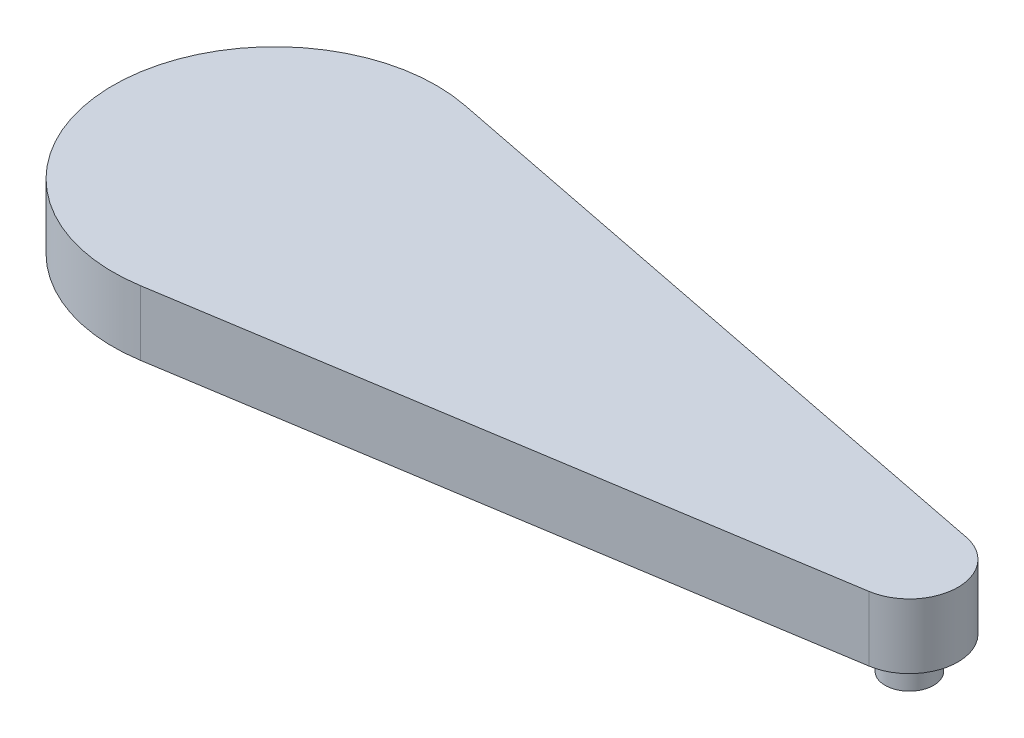
ISO-10303-21;
HEADER;
FILE_DESCRIPTION(('STEP AP214'),'2;1');
FILE_NAME('part.step','',(''),(''),'','','');
FILE_SCHEMA(('AUTOMOTIVE_DESIGN { 1 0 10303 214 1 1 1 1 }'));
ENDSEC;
DATA;
#1=APPLICATION_CONTEXT('core data for automotive mechanical design processes');
#2=APPLICATION_PROTOCOL_DEFINITION('international standard','automotive_design',2000,#1);
#3=PRODUCT_CONTEXT('',#1,'mechanical');
#4=PRODUCT('Part','Part','',(#3));
#5=PRODUCT_RELATED_PRODUCT_CATEGORY('part','',(#4));
#6=PRODUCT_DEFINITION_FORMATION('','',#4);
#7=PRODUCT_DEFINITION_CONTEXT('part definition',#1,'design');
#8=PRODUCT_DEFINITION('design','',#6,#7);
#9=PRODUCT_DEFINITION_SHAPE('','',#8);
#10=(LENGTH_UNIT() NAMED_UNIT(*) SI_UNIT(.MILLI.,.METRE.));
#11=(NAMED_UNIT(*) PLANE_ANGLE_UNIT() SI_UNIT($,.RADIAN.));
#12=(NAMED_UNIT(*) SI_UNIT($,.STERADIAN.) SOLID_ANGLE_UNIT());
#13=UNCERTAINTY_MEASURE_WITH_UNIT(LENGTH_MEASURE(1.E-05),#10,'distance_accuracy_value','');
#14=(GEOMETRIC_REPRESENTATION_CONTEXT(3) GLOBAL_UNCERTAINTY_ASSIGNED_CONTEXT((#13)) GLOBAL_UNIT_ASSIGNED_CONTEXT((#10,
#11,#12)) REPRESENTATION_CONTEXT('',''));
#15=CARTESIAN_POINT('',(0.,0.,0.));
#16=DIRECTION('',(0.,0.,1.));
#17=DIRECTION('',(1.,0.,0.));
#18=AXIS2_PLACEMENT_3D('',#15,#16,#17);
#19=CARTESIAN_POINT('',(100.,10.,1.89652606952907));
#20=DIRECTION('',(0.,-1.,0.));
#21=DIRECTION('',(0.,0.,-1.));
#22=AXIS2_PLACEMENT_3D('',#19,#20,#21);
#23=CYLINDRICAL_SURFACE('',#22,7.50000000000001);
#24=CARTESIAN_POINT('',(100.,0.,1.89652606952907));
#25=DIRECTION('',(0.,1.,0.));
#26=DIRECTION('',(0.,0.,1.));
#27=AXIS2_PLACEMENT_3D('',#24,#25,#26);
#28=CIRCLE('',#27,7.50000000000001);
#29=CARTESIAN_POINT('',(101.172007994329,0.,9.3043865745082));
#30=VERTEX_POINT('',#29);
#31=CARTESIAN_POINT('',(101.452048182224,0.,-5.46156852598264));
#32=VERTEX_POINT('',#31);
#33=EDGE_CURVE('E202',#30,#32,#28,.T.);
#34=ORIENTED_EDGE('',*,*,#33,.T.);
#35=DIRECTION('',(0.,-1.,0.));
#36=VECTOR('',#35,1.);
#37=CARTESIAN_POINT('',(101.452048182224,10.,-5.46156852598264));
#38=LINE('',#37,#36);
#39=CARTESIAN_POINT('',(101.452048182224,10.,-5.46156852598264));
#40=VERTEX_POINT('',#39);
#41=EDGE_CURVE('E11',#40,#32,#38,.T.);
#42=ORIENTED_EDGE('',*,*,#41,.F.);
#43=CARTESIAN_POINT('',(100.,10.,1.89652606952907));
#44=DIRECTION('',(0.,1.,0.));
#45=DIRECTION('',(0.,0.,1.));
#46=AXIS2_PLACEMENT_3D('',#43,#44,#45);
#47=CIRCLE('',#46,7.50000000000001);
#48=CARTESIAN_POINT('',(101.172007994329,10.,9.3043865745082));
#49=VERTEX_POINT('',#48);
#50=EDGE_CURVE('E216',#49,#40,#47,.T.);
#51=ORIENTED_EDGE('',*,*,#50,.F.);
#52=DIRECTION('',(0.,-1.,0.));
#53=VECTOR('',#52,1.);
#54=CARTESIAN_POINT('',(101.172007994329,10.,9.3043865745082));
#55=LINE('',#54,#53);
#56=EDGE_CURVE('E222',#49,#30,#55,.T.);
#57=ORIENTED_EDGE('',*,*,#56,.T.);
#58=EDGE_LOOP('',(#34,#42,#51,#57));
#59=FACE_BOUND('',#58,.T.);
#60=ADVANCED_FACE('F43',(#59),#23,.T.);
#61=CARTESIAN_POINT('',(101.452048182224,10.,-5.46156852598264));
#62=DIRECTION('',(-0.193606424296599,0.,0.981079279401561));
#63=DIRECTION('',(0.981079279401561,0.,0.193606424296599));
#64=AXIS2_PLACEMENT_3D('',#61,#62,#63);
#65=PLANE('',#64);
#66=DIRECTION('',(-0.981079279401561,0.,-0.193606424296599));
#67=VECTOR('',#66,1.);
#68=CARTESIAN_POINT('',(101.452048182224,0.,-5.46156852598264));
#69=LINE('',#68,#67);
#70=CARTESIAN_POINT('',(4.84016060741497,0.,-24.526981985039));
#71=VERTEX_POINT('',#70);
#72=EDGE_CURVE('E225',#32,#71,#69,.T.);
#73=ORIENTED_EDGE('',*,*,#72,.T.);
#74=DIRECTION('',(0.,-1.,0.));
#75=VECTOR('',#74,1.);
#76=CARTESIAN_POINT('',(4.84016060741497,10.,-24.526981985039));
#77=LINE('',#76,#75);
#78=CARTESIAN_POINT('',(4.84016060741497,10.,-24.526981985039));
#79=VERTEX_POINT('',#78);
#80=EDGE_CURVE('E50',#79,#71,#77,.T.);
#81=ORIENTED_EDGE('',*,*,#80,.F.);
#82=DIRECTION('',(-0.981079279401561,0.,-0.193606424296599));
#83=VECTOR('',#82,1.);
#84=CARTESIAN_POINT('',(101.452048182224,10.,-5.46156852598264));
#85=LINE('',#84,#83);
#86=EDGE_CURVE('E94',#40,#79,#85,.T.);
#87=ORIENTED_EDGE('',*,*,#86,.F.);
#88=ORIENTED_EDGE('',*,*,#41,.T.);
#89=EDGE_LOOP('',(#73,#81,#87,#88));
#90=FACE_BOUND('',#89,.T.);
#91=ADVANCED_FACE('F253',(#90),#65,.F.);
#92=CARTESIAN_POINT('',(0.,10.,0.));
#93=DIRECTION('',(0.,-1.,0.));
#94=DIRECTION('',(0.,0.,-1.));
#95=AXIS2_PLACEMENT_3D('',#92,#93,#94);
#96=CYLINDRICAL_SURFACE('',#95,25.);
#97=CARTESIAN_POINT('',(0.,0.,0.));
#98=DIRECTION('',(0.,1.,0.));
#99=DIRECTION('',(0.,0.,1.));
#100=AXIS2_PLACEMENT_3D('',#97,#98,#99);
#101=CIRCLE('',#100,25.);
#102=CARTESIAN_POINT('',(3.90669331442909,0.,24.6928683499304));
#103=VERTEX_POINT('',#102);
#104=EDGE_CURVE('E227',#71,#103,#101,.T.);
#105=ORIENTED_EDGE('',*,*,#104,.T.);
#106=DIRECTION('',(0.,-1.,0.));
#107=VECTOR('',#106,1.);
#108=CARTESIAN_POINT('',(3.90669331442909,10.,24.6928683499304));
#109=LINE('',#108,#107);
#110=CARTESIAN_POINT('',(3.90669331442909,10.,24.6928683499304));
#111=VERTEX_POINT('',#110);
#112=EDGE_CURVE('E231',#111,#103,#109,.T.);
#113=ORIENTED_EDGE('',*,*,#112,.F.);
#114=CARTESIAN_POINT('',(0.,10.,0.));
#115=DIRECTION('',(0.,1.,0.));
#116=DIRECTION('',(0.,0.,1.));
#117=AXIS2_PLACEMENT_3D('',#114,#115,#116);
#118=CIRCLE('',#117,25.);
#119=EDGE_CURVE('E219',#79,#111,#118,.T.);
#120=ORIENTED_EDGE('',*,*,#119,.F.);
#121=ORIENTED_EDGE('',*,*,#80,.T.);
#122=EDGE_LOOP('',(#105,#113,#120,#121));
#123=FACE_BOUND('',#122,.T.);
#124=ADVANCED_FACE('F236',(#123),#96,.T.);
#125=CARTESIAN_POINT('',(101.172007994329,10.,9.3043865745082));
#126=DIRECTION('',(-0.156267732577163,0.,-0.987714733997217));
#127=DIRECTION('',(-0.987714733997217,0.,0.156267732577163));
#128=AXIS2_PLACEMENT_3D('',#125,#126,#127);
#129=PLANE('',#128);
#130=DIRECTION('',(0.987714733997217,0.,-0.156267732577163));
#131=VECTOR('',#130,1.);
#132=CARTESIAN_POINT('',(101.172007994329,0.,9.3043865745082));
#133=LINE('',#132,#131);
#134=EDGE_CURVE('E87',#103,#30,#133,.T.);
#135=ORIENTED_EDGE('',*,*,#134,.T.);
#136=ORIENTED_EDGE('',*,*,#56,.F.);
#137=DIRECTION('',(0.987714733997217,0.,-0.156267732577163));
#138=VECTOR('',#137,1.);
#139=CARTESIAN_POINT('',(101.172007994329,10.,9.3043865745082));
#140=LINE('',#139,#138);
#141=EDGE_CURVE('E66',#111,#49,#140,.T.);
#142=ORIENTED_EDGE('',*,*,#141,.F.);
#143=ORIENTED_EDGE('',*,*,#112,.T.);
#144=EDGE_LOOP('',(#135,#136,#142,#143));
#145=FACE_BOUND('',#144,.T.);
#146=ADVANCED_FACE('F244',(#145),#129,.F.);
#147=CARTESIAN_POINT('',(100.,10.,1.89652606952907));
#148=DIRECTION('',(0.,1.,0.));
#149=DIRECTION('',(0.,0.,1.));
#150=AXIS2_PLACEMENT_3D('',#147,#148,#149);
#151=PLANE('',#150);
#152=ORIENTED_EDGE('',*,*,#50,.T.);
#153=ORIENTED_EDGE('',*,*,#86,.T.);
#154=ORIENTED_EDGE('',*,*,#119,.T.);
#155=ORIENTED_EDGE('',*,*,#141,.T.);
#156=EDGE_LOOP('',(#152,#153,#154,#155));
#157=FACE_BOUND('',#156,.T.);
#158=ADVANCED_FACE('F246',(#157),#151,.T.);
#159=CARTESIAN_POINT('',(100.,0.,1.89652606952907));
#160=DIRECTION('',(0.,1.,0.));
#161=DIRECTION('',(0.,0.,1.));
#162=AXIS2_PLACEMENT_3D('',#159,#160,#161);
#163=PLANE('',#162);
#164=DIRECTION('',(-0.984306181037937,0.,0.176469096361123));
#165=VECTOR('',#164,1.);
#166=CARTESIAN_POINT('',(17.5294072730355,0.,2.95291852296135));
#167=LINE('',#166,#165);
#168=CARTESIAN_POINT('',(17.5294072730355,0.,2.95291852296135));
#169=VERTEX_POINT('',#168);
#170=CARTESIAN_POINT('',(1.07598840365978,0.,5.90273232669805));
#171=VERTEX_POINT('',#170);
#172=EDGE_CURVE('E183',#169,#171,#167,.T.);
#173=ORIENTED_EDGE('',*,*,#172,.F.);
#174=CARTESIAN_POINT('',(16.9999998715484,0.,0.));
#175=DIRECTION('',(0.,-1.,0.));
#176=DIRECTION('',(0.,0.,-1.));
#177=AXIS2_PLACEMENT_3D('',#174,#175,#176);
#178=CIRCLE('',#177,2.99999999999961);
#179=CARTESIAN_POINT('',(17.529407273035,0.,-2.95291852296144));
#180=VERTEX_POINT('',#179);
#181=EDGE_CURVE('E57',#180,#169,#178,.T.);
#182=ORIENTED_EDGE('',*,*,#181,.F.);
#183=DIRECTION('',(0.984306181037938,0.,0.176469096361121));
#184=VECTOR('',#183,1.);
#185=CARTESIAN_POINT('',(17.529407273035,0.,-2.95291852296144));
#186=LINE('',#185,#184);
#187=CARTESIAN_POINT('',(1.07598840366077,0.,-5.90273232669858));
#188=VERTEX_POINT('',#187);
#189=EDGE_CURVE('E161',#188,#180,#186,.T.);
#190=ORIENTED_EDGE('',*,*,#189,.F.);
#191=CARTESIAN_POINT('',(-1.60479793142367E-08,0.,0.));
#192=DIRECTION('',(0.,-1.,0.));
#193=DIRECTION('',(0.,0.,-1.));
#194=AXIS2_PLACEMENT_3D('',#191,#192,#193);
#195=CIRCLE('',#194,5.99999999999998);
#196=CARTESIAN_POINT('',(-1.07598842178457,0.,-5.90273232924551));
#197=VERTEX_POINT('',#196);
#198=EDGE_CURVE('E164',#197,#188,#195,.T.);
#199=ORIENTED_EDGE('',*,*,#198,.F.);
#200=DIRECTION('',(0.984306181456321,0.,-0.176469094027473));
#201=VECTOR('',#200,1.);
#202=CARTESIAN_POINT('',(-17.5294072981501,0.,-2.95291856451748));
#203=LINE('',#202,#201);
#204=CARTESIAN_POINT('',(-17.5294072981501,0.,-2.95291856451748));
#205=VERTEX_POINT('',#204);
#206=EDGE_CURVE('E195',#205,#197,#203,.T.);
#207=ORIENTED_EDGE('',*,*,#206,.F.);
#208=CARTESIAN_POINT('',(-17.0000001284516,0.,0.));
#209=DIRECTION('',(0.,-1.,0.));
#210=DIRECTION('',(0.,0.,-1.));
#211=AXIS2_PLACEMENT_3D('',#208,#209,#210);
#212=CIRCLE('',#211,3.00000000000002);
#213=CARTESIAN_POINT('',(-17.529407298126,0.,2.95291856452179));
#214=VERTEX_POINT('',#213);
#215=EDGE_CURVE('E192',#214,#205,#212,.T.);
#216=ORIENTED_EDGE('',*,*,#215,.F.);
#217=DIRECTION('',(-0.984306181456334,0.,-0.176469094027395));
#218=VECTOR('',#217,1.);
#219=CARTESIAN_POINT('',(-17.529407298126,0.,2.95291856452179));
#220=LINE('',#219,#218);
#221=CARTESIAN_POINT('',(-1.07598842175312,0.,5.9027323292498));
#222=VERTEX_POINT('',#221);
#223=EDGE_CURVE('E189',#222,#214,#220,.T.);
#224=ORIENTED_EDGE('',*,*,#223,.F.);
#225=CARTESIAN_POINT('',(-1.60479793142367E-08,0.,0.));
#226=DIRECTION('',(0.,-1.,0.));
#227=DIRECTION('',(0.,0.,-1.));
#228=AXIS2_PLACEMENT_3D('',#225,#226,#227);
#229=CIRCLE('',#228,5.99999999999929);
#230=EDGE_CURVE('E186',#171,#222,#229,.T.);
#231=ORIENTED_EDGE('',*,*,#230,.F.);
#232=EDGE_LOOP('',(#173,#182,#190,#199,#207,#216,#224,#231));
#233=FACE_BOUND('',#232,.T.);
#234=CARTESIAN_POINT('',(100.,0.,1.89652606952907));
#235=DIRECTION('',(0.,-1.,0.));
#236=DIRECTION('',(0.,0.,-1.));
#237=AXIS2_PLACEMENT_3D('',#234,#235,#236);
#238=CIRCLE('',#237,3.75000000000001);
#239=CARTESIAN_POINT('',(100.,0.,-1.85347393047094));
#240=VERTEX_POINT('',#239);
#241=EDGE_CURVE('E184',#240,#240,#238,.T.);
#242=ORIENTED_EDGE('',*,*,#241,.F.);
#243=EDGE_LOOP('',(#242));
#244=FACE_BOUND('',#243,.T.);
#245=ORIENTED_EDGE('',*,*,#33,.F.);
#246=ORIENTED_EDGE('',*,*,#134,.F.);
#247=ORIENTED_EDGE('',*,*,#104,.F.);
#248=ORIENTED_EDGE('',*,*,#72,.F.);
#249=EDGE_LOOP('',(#245,#246,#247,#248));
#250=FACE_BOUND('',#249,.T.);
#251=ADVANCED_FACE('F240',(#233,#244,#250),#163,.F.);
#252=CARTESIAN_POINT('',(16.9999998715484,5.,0.));
#253=DIRECTION('',(0.,-1.,0.));
#254=DIRECTION('',(0.,0.,-1.));
#255=AXIS2_PLACEMENT_3D('',#252,#253,#254);
#256=CYLINDRICAL_SURFACE('',#255,2.99999999999961);
#257=ORIENTED_EDGE('',*,*,#181,.T.);
#258=DIRECTION('',(0.,-1.,0.));
#259=VECTOR('',#258,1.);
#260=CARTESIAN_POINT('',(17.5294072730355,5.,2.95291852296135));
#261=LINE('',#260,#259);
#262=CARTESIAN_POINT('',(17.5294072730355,5.,2.95291852296135));
#263=VERTEX_POINT('',#262);
#264=EDGE_CURVE('E138',#263,#169,#261,.T.);
#265=ORIENTED_EDGE('',*,*,#264,.F.);
#266=CARTESIAN_POINT('',(16.9999998715484,5.,0.));
#267=DIRECTION('',(0.,-1.,0.));
#268=DIRECTION('',(0.,0.,-1.));
#269=AXIS2_PLACEMENT_3D('',#266,#267,#268);
#270=CIRCLE('',#269,2.99999999999961);
#271=CARTESIAN_POINT('',(17.529407273035,5.,-2.95291852296144));
#272=VERTEX_POINT('',#271);
#273=EDGE_CURVE('E142',#272,#263,#270,.T.);
#274=ORIENTED_EDGE('',*,*,#273,.F.);
#275=DIRECTION('',(0.,-1.,0.));
#276=VECTOR('',#275,1.);
#277=CARTESIAN_POINT('',(17.529407273035,5.,-2.95291852296144));
#278=LINE('',#277,#276);
#279=EDGE_CURVE('E200',#272,#180,#278,.T.);
#280=ORIENTED_EDGE('',*,*,#279,.T.);
#281=EDGE_LOOP('',(#257,#265,#274,#280));
#282=FACE_BOUND('',#281,.T.);
#283=ADVANCED_FACE('F140',(#282),#256,.F.);
#284=CARTESIAN_POINT('',(17.529407273035,5.,-2.95291852296144));
#285=DIRECTION('',(0.176469096361121,0.,-0.984306181037938));
#286=DIRECTION('',(-0.984306181037938,0.,-0.176469096361121));
#287=AXIS2_PLACEMENT_3D('',#284,#285,#286);
#288=PLANE('',#287);
#289=ORIENTED_EDGE('',*,*,#189,.T.);
#290=ORIENTED_EDGE('',*,*,#279,.F.);
#291=DIRECTION('',(0.984306181037938,0.,0.176469096361121));
#292=VECTOR('',#291,1.);
#293=CARTESIAN_POINT('',(17.529407273035,5.,-2.95291852296144));
#294=LINE('',#293,#292);
#295=CARTESIAN_POINT('',(1.07598840366077,5.,-5.90273232669858));
#296=VERTEX_POINT('',#295);
#297=EDGE_CURVE('E148',#296,#272,#294,.T.);
#298=ORIENTED_EDGE('',*,*,#297,.F.);
#299=DIRECTION('',(0.,-1.,0.));
#300=VECTOR('',#299,1.);
#301=CARTESIAN_POINT('',(1.07598840366077,5.,-5.90273232669858));
#302=LINE('',#301,#300);
#303=EDGE_CURVE('E203',#296,#188,#302,.T.);
#304=ORIENTED_EDGE('',*,*,#303,.T.);
#305=EDGE_LOOP('',(#289,#290,#298,#304));
#306=FACE_BOUND('',#305,.T.);
#307=ADVANCED_FACE('F297',(#306),#288,.F.);
#308=CARTESIAN_POINT('',(-1.60479793142367E-08,5.,0.));
#309=DIRECTION('',(0.,-1.,0.));
#310=DIRECTION('',(0.,0.,-1.));
#311=AXIS2_PLACEMENT_3D('',#308,#309,#310);
#312=CYLINDRICAL_SURFACE('',#311,5.99999999999998);
#313=ORIENTED_EDGE('',*,*,#198,.T.);
#314=ORIENTED_EDGE('',*,*,#303,.F.);
#315=CARTESIAN_POINT('',(-1.60479793142367E-08,5.,0.));
#316=DIRECTION('',(0.,-1.,0.));
#317=DIRECTION('',(0.,0.,-1.));
#318=AXIS2_PLACEMENT_3D('',#315,#316,#317);
#319=CIRCLE('',#318,5.99999999999998);
#320=CARTESIAN_POINT('',(-1.07598842178457,5.,-5.90273232924551));
#321=VERTEX_POINT('',#320);
#322=EDGE_CURVE('E179',#321,#296,#319,.T.);
#323=ORIENTED_EDGE('',*,*,#322,.F.);
#324=DIRECTION('',(0.,-1.,0.));
#325=VECTOR('',#324,1.);
#326=CARTESIAN_POINT('',(-1.07598842178457,5.,-5.90273232924551));
#327=LINE('',#326,#325);
#328=EDGE_CURVE('E205',#321,#197,#327,.T.);
#329=ORIENTED_EDGE('',*,*,#328,.T.);
#330=EDGE_LOOP('',(#313,#314,#323,#329));
#331=FACE_BOUND('',#330,.T.);
#332=ADVANCED_FACE('F307',(#331),#312,.F.);
#333=CARTESIAN_POINT('',(-17.5294072981501,5.,-2.95291856451748));
#334=DIRECTION('',(-0.176469094027473,0.,-0.984306181456321));
#335=DIRECTION('',(-0.984306181456321,0.,0.176469094027473));
#336=AXIS2_PLACEMENT_3D('',#333,#334,#335);
#337=PLANE('',#336);
#338=ORIENTED_EDGE('',*,*,#206,.T.);
#339=ORIENTED_EDGE('',*,*,#328,.F.);
#340=DIRECTION('',(0.984306181456321,0.,-0.176469094027473));
#341=VECTOR('',#340,1.);
#342=CARTESIAN_POINT('',(-17.5294072981501,5.,-2.95291856451748));
#343=LINE('',#342,#341);
#344=CARTESIAN_POINT('',(-17.5294072981501,5.,-2.95291856451748));
#345=VERTEX_POINT('',#344);
#346=EDGE_CURVE('E176',#345,#321,#343,.T.);
#347=ORIENTED_EDGE('',*,*,#346,.F.);
#348=DIRECTION('',(0.,-1.,0.));
#349=VECTOR('',#348,1.);
#350=CARTESIAN_POINT('',(-17.5294072981501,5.,-2.95291856451748));
#351=LINE('',#350,#349);
#352=EDGE_CURVE('E207',#345,#205,#351,.T.);
#353=ORIENTED_EDGE('',*,*,#352,.T.);
#354=EDGE_LOOP('',(#338,#339,#347,#353));
#355=FACE_BOUND('',#354,.T.);
#356=ADVANCED_FACE('F318',(#355),#337,.F.);
#357=CARTESIAN_POINT('',(-17.0000001284516,5.,0.));
#358=DIRECTION('',(0.,-1.,0.));
#359=DIRECTION('',(0.,0.,-1.));
#360=AXIS2_PLACEMENT_3D('',#357,#358,#359);
#361=CYLINDRICAL_SURFACE('',#360,3.00000000000002);
#362=ORIENTED_EDGE('',*,*,#215,.T.);
#363=ORIENTED_EDGE('',*,*,#352,.F.);
#364=CARTESIAN_POINT('',(-17.0000001284516,5.,0.));
#365=DIRECTION('',(0.,-1.,0.));
#366=DIRECTION('',(0.,0.,-1.));
#367=AXIS2_PLACEMENT_3D('',#364,#365,#366);
#368=CIRCLE('',#367,3.00000000000002);
#369=CARTESIAN_POINT('',(-17.529407298126,5.,2.95291856452179));
#370=VERTEX_POINT('',#369);
#371=EDGE_CURVE('E173',#370,#345,#368,.T.);
#372=ORIENTED_EDGE('',*,*,#371,.F.);
#373=DIRECTION('',(0.,-1.,0.));
#374=VECTOR('',#373,1.);
#375=CARTESIAN_POINT('',(-17.529407298126,5.,2.95291856452179));
#376=LINE('',#375,#374);
#377=EDGE_CURVE('E209',#370,#214,#376,.T.);
#378=ORIENTED_EDGE('',*,*,#377,.T.);
#379=EDGE_LOOP('',(#362,#363,#372,#378));
#380=FACE_BOUND('',#379,.T.);
#381=ADVANCED_FACE('F329',(#380),#361,.F.);
#382=CARTESIAN_POINT('',(-17.529407298126,5.,2.95291856452179));
#383=DIRECTION('',(-0.176469094027395,0.,0.984306181456335));
#384=DIRECTION('',(0.984306181456335,0.,0.176469094027395));
#385=AXIS2_PLACEMENT_3D('',#382,#383,#384);
#386=PLANE('',#385);
#387=ORIENTED_EDGE('',*,*,#223,.T.);
#388=ORIENTED_EDGE('',*,*,#377,.F.);
#389=DIRECTION('',(-0.984306181456334,0.,-0.176469094027395));
#390=VECTOR('',#389,1.);
#391=CARTESIAN_POINT('',(-17.529407298126,5.,2.95291856452179));
#392=LINE('',#391,#390);
#393=CARTESIAN_POINT('',(-1.07598842175312,5.,5.9027323292498));
#394=VERTEX_POINT('',#393);
#395=EDGE_CURVE('E170',#394,#370,#392,.T.);
#396=ORIENTED_EDGE('',*,*,#395,.F.);
#397=DIRECTION('',(0.,-1.,0.));
#398=VECTOR('',#397,1.);
#399=CARTESIAN_POINT('',(-1.07598842175312,5.,5.9027323292498));
#400=LINE('',#399,#398);
#401=EDGE_CURVE('E211',#394,#222,#400,.T.);
#402=ORIENTED_EDGE('',*,*,#401,.T.);
#403=EDGE_LOOP('',(#387,#388,#396,#402));
#404=FACE_BOUND('',#403,.T.);
#405=ADVANCED_FACE('F340',(#404),#386,.F.);
#406=CARTESIAN_POINT('',(-1.60479793142367E-08,5.,0.));
#407=DIRECTION('',(0.,-1.,0.));
#408=DIRECTION('',(0.,0.,-1.));
#409=AXIS2_PLACEMENT_3D('',#406,#407,#408);
#410=CYLINDRICAL_SURFACE('',#409,5.99999999999929);
#411=ORIENTED_EDGE('',*,*,#230,.T.);
#412=ORIENTED_EDGE('',*,*,#401,.F.);
#413=CARTESIAN_POINT('',(-1.60479793142367E-08,5.,0.));
#414=DIRECTION('',(0.,-1.,0.));
#415=DIRECTION('',(0.,0.,-1.));
#416=AXIS2_PLACEMENT_3D('',#413,#414,#415);
#417=CIRCLE('',#416,5.99999999999929);
#418=CARTESIAN_POINT('',(1.07598840365978,5.,5.90273232669805));
#419=VERTEX_POINT('',#418);
#420=EDGE_CURVE('E156',#419,#394,#417,.T.);
#421=ORIENTED_EDGE('',*,*,#420,.F.);
#422=DIRECTION('',(0.,-1.,0.));
#423=VECTOR('',#422,1.);
#424=CARTESIAN_POINT('',(1.07598840365978,5.,5.90273232669805));
#425=LINE('',#424,#423);
#426=EDGE_CURVE('E147',#419,#171,#425,.T.);
#427=ORIENTED_EDGE('',*,*,#426,.T.);
#428=EDGE_LOOP('',(#411,#412,#421,#427));
#429=FACE_BOUND('',#428,.T.);
#430=ADVANCED_FACE('F351',(#429),#410,.F.);
#431=CARTESIAN_POINT('',(17.5294072730355,5.,2.95291852296135));
#432=DIRECTION('',(0.176469096361123,0.,0.984306181037937));
#433=DIRECTION('',(0.984306181037937,0.,-0.176469096361123));
#434=AXIS2_PLACEMENT_3D('',#431,#432,#433);
#435=PLANE('',#434);
#436=ORIENTED_EDGE('',*,*,#172,.T.);
#437=ORIENTED_EDGE('',*,*,#426,.F.);
#438=DIRECTION('',(-0.984306181037937,0.,0.176469096361123));
#439=VECTOR('',#438,1.);
#440=CARTESIAN_POINT('',(17.5294072730355,5.,2.95291852296135));
#441=LINE('',#440,#439);
#442=EDGE_CURVE('E151',#263,#419,#441,.T.);
#443=ORIENTED_EDGE('',*,*,#442,.F.);
#444=ORIENTED_EDGE('',*,*,#264,.T.);
#445=EDGE_LOOP('',(#436,#437,#443,#444));
#446=FACE_BOUND('',#445,.T.);
#447=ADVANCED_FACE('F152',(#446),#435,.F.);
#448=CARTESIAN_POINT('',(16.9999998715484,5.,0.));
#449=DIRECTION('',(0.,-1.,0.));
#450=DIRECTION('',(0.,0.,-1.));
#451=AXIS2_PLACEMENT_3D('',#448,#449,#450);
#452=PLANE('',#451);
#453=ORIENTED_EDGE('',*,*,#273,.T.);
#454=ORIENTED_EDGE('',*,*,#442,.T.);
#455=ORIENTED_EDGE('',*,*,#420,.T.);
#456=ORIENTED_EDGE('',*,*,#395,.T.);
#457=ORIENTED_EDGE('',*,*,#371,.T.);
#458=ORIENTED_EDGE('',*,*,#346,.T.);
#459=ORIENTED_EDGE('',*,*,#322,.T.);
#460=ORIENTED_EDGE('',*,*,#297,.T.);
#461=EDGE_LOOP('',(#453,#454,#455,#456,#457,#458,#459,#460));
#462=FACE_BOUND('',#461,.T.);
#463=ADVANCED_FACE('F158',(#462),#452,.T.);
#464=CARTESIAN_POINT('',(100.,-5.,1.89652606952907));
#465=DIRECTION('',(0.,1.,0.));
#466=DIRECTION('',(0.,0.,1.));
#467=AXIS2_PLACEMENT_3D('',#464,#465,#466);
#468=CYLINDRICAL_SURFACE('',#467,3.75000000000001);
#469=CARTESIAN_POINT('',(100.,-5.,1.89652606952907));
#470=DIRECTION('',(0.,-1.,0.));
#471=DIRECTION('',(0.,0.,-1.));
#472=AXIS2_PLACEMENT_3D('',#469,#470,#471);
#473=CIRCLE('',#472,3.75000000000001);
#474=CARTESIAN_POINT('',(100.,-5.,-1.85347393047094));
#475=VERTEX_POINT('',#474);
#476=EDGE_CURVE('E167',#475,#475,#473,.T.);
#477=ORIENTED_EDGE('',*,*,#476,.F.);
#478=EDGE_LOOP('',(#477));
#479=FACE_BOUND('',#478,.T.);
#480=ORIENTED_EDGE('',*,*,#241,.T.);
#481=EDGE_LOOP('',(#480));
#482=FACE_BOUND('',#481,.T.);
#483=ADVANCED_FACE('F381',(#479,#482),#468,.T.);
#484=CARTESIAN_POINT('',(100.,-5.,1.89652606952907));
#485=DIRECTION('',(0.,-1.,0.));
#486=DIRECTION('',(0.,0.,-1.));
#487=AXIS2_PLACEMENT_3D('',#484,#485,#486);
#488=PLANE('',#487);
#489=ORIENTED_EDGE('',*,*,#476,.T.);
#490=EDGE_LOOP('',(#489));
#491=FACE_BOUND('',#490,.T.);
#492=ADVANCED_FACE('F391',(#491),#488,.T.);
#493=CLOSED_SHELL('',(#60,#91,#124,#146,#158,#251,#283,#307,#332,#356,#381,#405,#430,#447,#463,
#483,#492));
#494=MANIFOLD_SOLID_BREP('B2',#493);
#495=ADVANCED_BREP_SHAPE_REPRESENTATION('',(#18,#494),#14);
#496=SHAPE_DEFINITION_REPRESENTATION(#9,#495);
ENDSEC;
END-ISO-10303-21;
